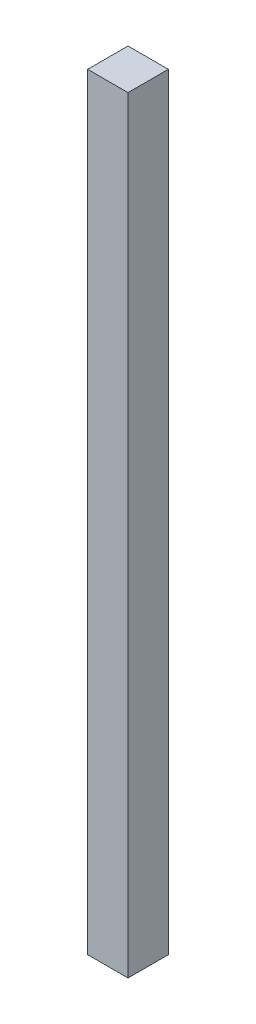
ISO-10303-21;
HEADER;
FILE_DESCRIPTION(('STEP AP214'),'2;1');
FILE_NAME('part.step','',(''),(''),'','','');
FILE_SCHEMA(('AUTOMOTIVE_DESIGN { 1 0 10303 214 1 1 1 1 }'));
ENDSEC;
DATA;
#1=APPLICATION_CONTEXT('core data for automotive mechanical design processes');
#2=APPLICATION_PROTOCOL_DEFINITION('international standard','automotive_design',2000,#1);
#3=PRODUCT_CONTEXT('',#1,'mechanical');
#4=PRODUCT('Part','Part','',(#3));
#5=PRODUCT_RELATED_PRODUCT_CATEGORY('part','',(#4));
#6=PRODUCT_DEFINITION_FORMATION('','',#4);
#7=PRODUCT_DEFINITION_CONTEXT('part definition',#1,'design');
#8=PRODUCT_DEFINITION('design','',#6,#7);
#9=PRODUCT_DEFINITION_SHAPE('','',#8);
#10=(LENGTH_UNIT() NAMED_UNIT(*) SI_UNIT(.MILLI.,.METRE.));
#11=(NAMED_UNIT(*) PLANE_ANGLE_UNIT() SI_UNIT($,.RADIAN.));
#12=(NAMED_UNIT(*) SI_UNIT($,.STERADIAN.) SOLID_ANGLE_UNIT());
#13=UNCERTAINTY_MEASURE_WITH_UNIT(LENGTH_MEASURE(1.E-05),#10,'distance_accuracy_value','');
#14=(GEOMETRIC_REPRESENTATION_CONTEXT(3) GLOBAL_UNCERTAINTY_ASSIGNED_CONTEXT((#13)) GLOBAL_UNIT_ASSIGNED_CONTEXT((#10,
#11,#12)) REPRESENTATION_CONTEXT('',''));
#15=CARTESIAN_POINT('',(0.,0.,0.));
#16=DIRECTION('',(0.,0.,1.));
#17=DIRECTION('',(1.,0.,0.));
#18=AXIS2_PLACEMENT_3D('',#15,#16,#17);
#19=CARTESIAN_POINT('',(0.,190.,0.));
#20=DIRECTION('',(1.,0.,0.));
#21=DIRECTION('',(0.,0.,-1.));
#22=AXIS2_PLACEMENT_3D('',#19,#20,#21);
#23=PLANE('',#22);
#24=DIRECTION('',(0.,0.,1.));
#25=VECTOR('',#24,1.);
#26=CARTESIAN_POINT('',(0.,0.,0.));
#27=LINE('',#26,#25);
#28=CARTESIAN_POINT('',(0.,0.,-10.));
#29=VERTEX_POINT('',#28);
#30=CARTESIAN_POINT('',(0.,0.,0.));
#31=VERTEX_POINT('',#30);
#32=EDGE_CURVE('E94',#29,#31,#27,.T.);
#33=ORIENTED_EDGE('',*,*,#32,.T.);
#34=DIRECTION('',(0.,-1.,0.));
#35=VECTOR('',#34,1.);
#36=CARTESIAN_POINT('',(0.,190.,0.));
#37=LINE('',#36,#35);
#38=CARTESIAN_POINT('',(0.,190.,0.));
#39=VERTEX_POINT('',#38);
#40=EDGE_CURVE('E11',#39,#31,#37,.T.);
#41=ORIENTED_EDGE('',*,*,#40,.F.);
#42=DIRECTION('',(0.,0.,1.));
#43=VECTOR('',#42,1.);
#44=CARTESIAN_POINT('',(0.,190.,0.));
#45=LINE('',#44,#43);
#46=CARTESIAN_POINT('',(0.,190.,-10.));
#47=VERTEX_POINT('',#46);
#48=EDGE_CURVE('E82',#47,#39,#45,.T.);
#49=ORIENTED_EDGE('',*,*,#48,.F.);
#50=DIRECTION('',(0.,-1.,0.));
#51=VECTOR('',#50,1.);
#52=CARTESIAN_POINT('',(0.,190.,-10.));
#53=LINE('',#52,#51);
#54=EDGE_CURVE('E90',#47,#29,#53,.T.);
#55=ORIENTED_EDGE('',*,*,#54,.T.);
#56=EDGE_LOOP('',(#33,#41,#49,#55));
#57=FACE_BOUND('',#56,.T.);
#58=ADVANCED_FACE('F31',(#57),#23,.F.);
#59=CARTESIAN_POINT('',(0.,190.,0.));
#60=DIRECTION('',(0.,0.,-1.));
#61=DIRECTION('',(-1.,0.,0.));
#62=AXIS2_PLACEMENT_3D('',#59,#60,#61);
#63=PLANE('',#62);
#64=DIRECTION('',(1.,0.,0.));
#65=VECTOR('',#64,1.);
#66=CARTESIAN_POINT('',(0.,0.,0.));
#67=LINE('',#66,#65);
#68=CARTESIAN_POINT('',(10.,0.,0.));
#69=VERTEX_POINT('',#68);
#70=EDGE_CURVE('E86',#31,#69,#67,.T.);
#71=ORIENTED_EDGE('',*,*,#70,.T.);
#72=DIRECTION('',(0.,-1.,0.));
#73=VECTOR('',#72,1.);
#74=CARTESIAN_POINT('',(10.,190.,0.));
#75=LINE('',#74,#73);
#76=CARTESIAN_POINT('',(10.,190.,0.));
#77=VERTEX_POINT('',#76);
#78=EDGE_CURVE('E39',#77,#69,#75,.T.);
#79=ORIENTED_EDGE('',*,*,#78,.F.);
#80=DIRECTION('',(1.,0.,0.));
#81=VECTOR('',#80,1.);
#82=CARTESIAN_POINT('',(0.,190.,0.));
#83=LINE('',#82,#81);
#84=EDGE_CURVE('E77',#39,#77,#83,.T.);
#85=ORIENTED_EDGE('',*,*,#84,.F.);
#86=ORIENTED_EDGE('',*,*,#40,.T.);
#87=EDGE_LOOP('',(#71,#79,#85,#86));
#88=FACE_BOUND('',#87,.T.);
#89=ADVANCED_FACE('F85',(#88),#63,.F.);
#90=CARTESIAN_POINT('',(10.,190.,0.));
#91=DIRECTION('',(-1.,0.,0.));
#92=DIRECTION('',(0.,0.,1.));
#93=AXIS2_PLACEMENT_3D('',#90,#91,#92);
#94=PLANE('',#93);
#95=DIRECTION('',(0.,0.,-1.));
#96=VECTOR('',#95,1.);
#97=CARTESIAN_POINT('',(10.,0.,0.));
#98=LINE('',#97,#96);
#99=CARTESIAN_POINT('',(10.,0.,-10.));
#100=VERTEX_POINT('',#99);
#101=EDGE_CURVE('E64',#69,#100,#98,.T.);
#102=ORIENTED_EDGE('',*,*,#101,.T.);
#103=DIRECTION('',(0.,-1.,0.));
#104=VECTOR('',#103,1.);
#105=CARTESIAN_POINT('',(10.,190.,-10.));
#106=LINE('',#105,#104);
#107=CARTESIAN_POINT('',(10.,190.,-10.));
#108=VERTEX_POINT('',#107);
#109=EDGE_CURVE('E87',#108,#100,#106,.T.);
#110=ORIENTED_EDGE('',*,*,#109,.F.);
#111=DIRECTION('',(0.,0.,-1.));
#112=VECTOR('',#111,1.);
#113=CARTESIAN_POINT('',(10.,190.,0.));
#114=LINE('',#113,#112);
#115=EDGE_CURVE('E80',#77,#108,#114,.T.);
#116=ORIENTED_EDGE('',*,*,#115,.F.);
#117=ORIENTED_EDGE('',*,*,#78,.T.);
#118=EDGE_LOOP('',(#102,#110,#116,#117));
#119=FACE_BOUND('',#118,.T.);
#120=ADVANCED_FACE('F88',(#119),#94,.F.);
#121=CARTESIAN_POINT('',(0.,190.,-10.));
#122=DIRECTION('',(0.,0.,1.));
#123=DIRECTION('',(1.,0.,0.));
#124=AXIS2_PLACEMENT_3D('',#121,#122,#123);
#125=PLANE('',#124);
#126=DIRECTION('',(-1.,0.,0.));
#127=VECTOR('',#126,1.);
#128=CARTESIAN_POINT('',(0.,0.,-10.));
#129=LINE('',#128,#127);
#130=EDGE_CURVE('E70',#100,#29,#129,.T.);
#131=ORIENTED_EDGE('',*,*,#130,.T.);
#132=ORIENTED_EDGE('',*,*,#54,.F.);
#133=DIRECTION('',(-1.,0.,0.));
#134=VECTOR('',#133,1.);
#135=CARTESIAN_POINT('',(0.,190.,-10.));
#136=LINE('',#135,#134);
#137=EDGE_CURVE('E47',#108,#47,#136,.T.);
#138=ORIENTED_EDGE('',*,*,#137,.F.);
#139=ORIENTED_EDGE('',*,*,#109,.T.);
#140=EDGE_LOOP('',(#131,#132,#138,#139));
#141=FACE_BOUND('',#140,.T.);
#142=ADVANCED_FACE('F101',(#141),#125,.F.);
#143=CARTESIAN_POINT('',(0.,190.,-10.));
#144=DIRECTION('',(0.,-1.,0.));
#145=DIRECTION('',(0.,0.,-1.));
#146=AXIS2_PLACEMENT_3D('',#143,#144,#145);
#147=PLANE('',#146);
#148=ORIENTED_EDGE('',*,*,#48,.T.);
#149=ORIENTED_EDGE('',*,*,#84,.T.);
#150=ORIENTED_EDGE('',*,*,#115,.T.);
#151=ORIENTED_EDGE('',*,*,#137,.T.);
#152=EDGE_LOOP('',(#148,#149,#150,#151));
#153=FACE_BOUND('',#152,.T.);
#154=ADVANCED_FACE('F78',(#153),#147,.F.);
#155=CARTESIAN_POINT('',(0.,0.,-10.));
#156=DIRECTION('',(0.,-1.,0.));
#157=DIRECTION('',(0.,0.,-1.));
#158=AXIS2_PLACEMENT_3D('',#155,#156,#157);
#159=PLANE('',#158);
#160=ORIENTED_EDGE('',*,*,#32,.F.);
#161=ORIENTED_EDGE('',*,*,#130,.F.);
#162=ORIENTED_EDGE('',*,*,#101,.F.);
#163=ORIENTED_EDGE('',*,*,#70,.F.);
#164=EDGE_LOOP('',(#160,#161,#162,#163));
#165=FACE_BOUND('',#164,.T.);
#166=ADVANCED_FACE('F104',(#165),#159,.T.);
#167=CLOSED_SHELL('',(#58,#89,#120,#142,#154,#166));
#168=MANIFOLD_SOLID_BREP('B2',#167);
#169=ADVANCED_BREP_SHAPE_REPRESENTATION('',(#18,#168),#14);
#170=SHAPE_DEFINITION_REPRESENTATION(#9,#169);
ENDSEC;
END-ISO-10303-21;
